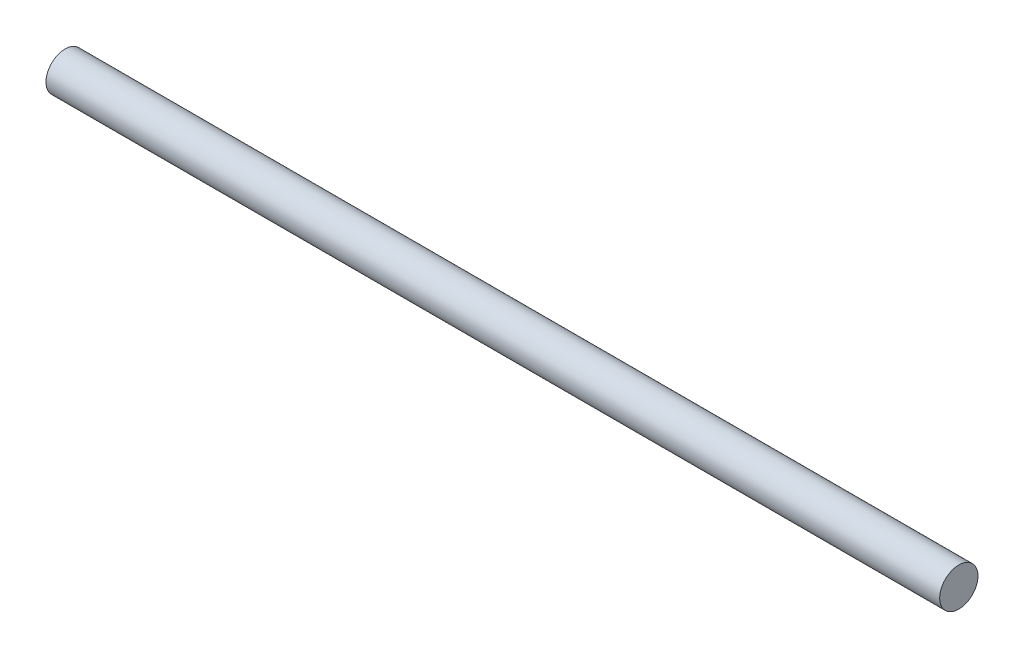
ISO-10303-21;
HEADER;
FILE_DESCRIPTION(('STEP AP214'),'2;1');
FILE_NAME('part.step','',(''),(''),'','','');
FILE_SCHEMA(('AUTOMOTIVE_DESIGN { 1 0 10303 214 1 1 1 1 }'));
ENDSEC;
DATA;
#1=APPLICATION_CONTEXT('core data for automotive mechanical design processes');
#2=APPLICATION_PROTOCOL_DEFINITION('international standard','automotive_design',2000,#1);
#3=PRODUCT_CONTEXT('',#1,'mechanical');
#4=PRODUCT('Part','Part','',(#3));
#5=PRODUCT_RELATED_PRODUCT_CATEGORY('part','',(#4));
#6=PRODUCT_DEFINITION_FORMATION('','',#4);
#7=PRODUCT_DEFINITION_CONTEXT('part definition',#1,'design');
#8=PRODUCT_DEFINITION('design','',#6,#7);
#9=PRODUCT_DEFINITION_SHAPE('','',#8);
#10=(LENGTH_UNIT() NAMED_UNIT(*) SI_UNIT(.MILLI.,.METRE.));
#11=(NAMED_UNIT(*) PLANE_ANGLE_UNIT() SI_UNIT($,.RADIAN.));
#12=(NAMED_UNIT(*) SI_UNIT($,.STERADIAN.) SOLID_ANGLE_UNIT());
#13=UNCERTAINTY_MEASURE_WITH_UNIT(LENGTH_MEASURE(1.E-05),#10,'distance_accuracy_value','');
#14=(GEOMETRIC_REPRESENTATION_CONTEXT(3) GLOBAL_UNCERTAINTY_ASSIGNED_CONTEXT((#13)) GLOBAL_UNIT_ASSIGNED_CONTEXT((#10,
#11,#12)) REPRESENTATION_CONTEXT('',''));
#15=CARTESIAN_POINT('',(0.,0.,0.));
#16=DIRECTION('',(0.,0.,1.));
#17=DIRECTION('',(1.,0.,0.));
#18=AXIS2_PLACEMENT_3D('',#15,#16,#17);
#19=CARTESIAN_POINT('',(70.,0.,0.));
#20=DIRECTION('',(-1.,0.,0.));
#21=DIRECTION('',(0.,0.,1.));
#22=AXIS2_PLACEMENT_3D('',#19,#20,#21);
#23=CYLINDRICAL_SURFACE('',#22,1.5);
#24=CARTESIAN_POINT('',(70.,0.,0.));
#25=DIRECTION('',(1.,0.,0.));
#26=DIRECTION('',(0.,0.,-1.));
#27=AXIS2_PLACEMENT_3D('',#24,#25,#26);
#28=CIRCLE('',#27,1.5);
#29=CARTESIAN_POINT('',(70.,0.,-1.5));
#30=VERTEX_POINT('',#29);
#31=EDGE_CURVE('E10',#30,#30,#28,.T.);
#32=ORIENTED_EDGE('',*,*,#31,.F.);
#33=EDGE_LOOP('',(#32));
#34=FACE_BOUND('',#33,.T.);
#35=CARTESIAN_POINT('',(0.,0.,0.));
#36=DIRECTION('',(1.,0.,0.));
#37=DIRECTION('',(0.,0.,-1.));
#38=AXIS2_PLACEMENT_3D('',#35,#36,#37);
#39=CIRCLE('',#38,1.5);
#40=CARTESIAN_POINT('',(0.,0.,-1.5));
#41=VERTEX_POINT('',#40);
#42=EDGE_CURVE('E33',#41,#41,#39,.T.);
#43=ORIENTED_EDGE('',*,*,#42,.T.);
#44=EDGE_LOOP('',(#43));
#45=FACE_BOUND('',#44,.T.);
#46=ADVANCED_FACE('F30',(#34,#45),#23,.T.);
#47=CARTESIAN_POINT('',(70.,0.,0.));
#48=DIRECTION('',(1.,0.,0.));
#49=DIRECTION('',(0.,0.,-1.));
#50=AXIS2_PLACEMENT_3D('',#47,#48,#49);
#51=PLANE('',#50);
#52=ORIENTED_EDGE('',*,*,#31,.T.);
#53=EDGE_LOOP('',(#52));
#54=FACE_BOUND('',#53,.T.);
#55=ADVANCED_FACE('F45',(#54),#51,.T.);
#56=CARTESIAN_POINT('',(0.,0.,0.));
#57=DIRECTION('',(1.,0.,0.));
#58=DIRECTION('',(0.,0.,-1.));
#59=AXIS2_PLACEMENT_3D('',#56,#57,#58);
#60=PLANE('',#59);
#61=ORIENTED_EDGE('',*,*,#42,.F.);
#62=EDGE_LOOP('',(#61));
#63=FACE_BOUND('',#62,.T.);
#64=ADVANCED_FACE('F43',(#63),#60,.F.);
#65=CLOSED_SHELL('',(#46,#55,#64));
#66=MANIFOLD_SOLID_BREP('B2',#65);
#67=ADVANCED_BREP_SHAPE_REPRESENTATION('',(#18,#66),#14);
#68=SHAPE_DEFINITION_REPRESENTATION(#9,#67);
ENDSEC;
END-ISO-10303-21;
